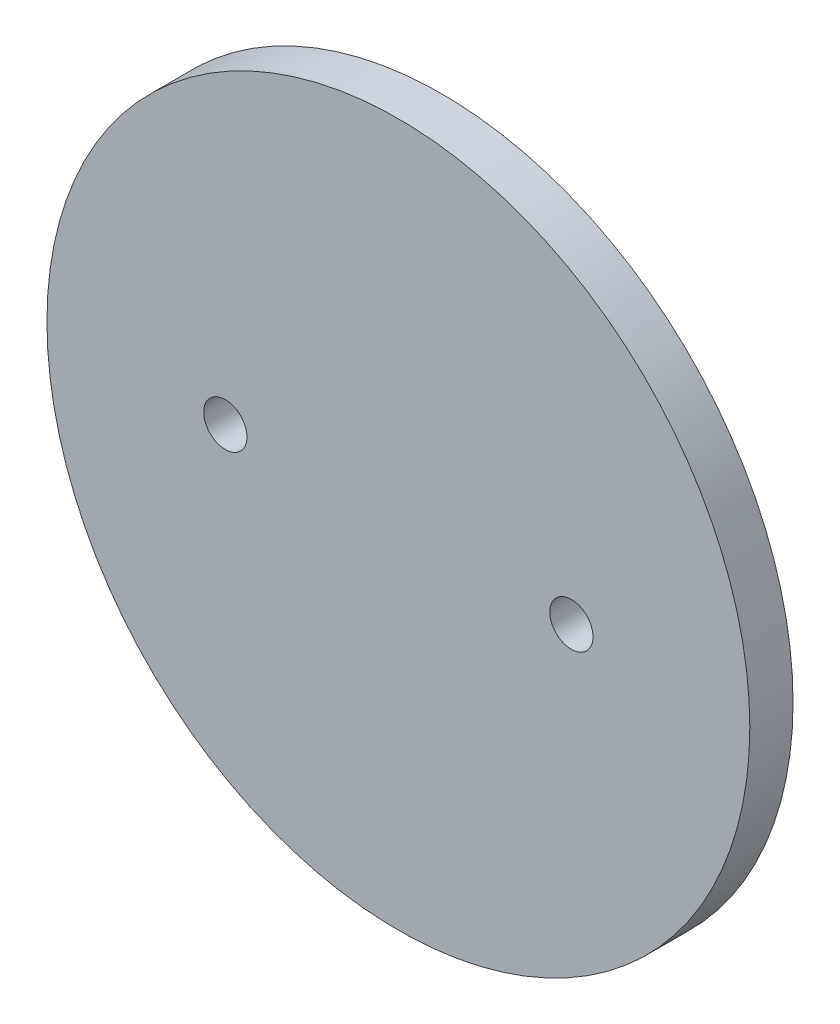
ISO-10303-21;
HEADER;
FILE_DESCRIPTION(('STEP AP214'),'2;1');
FILE_NAME('part.step','',(''),(''),'','','');
FILE_SCHEMA(('AUTOMOTIVE_DESIGN { 1 0 10303 214 1 1 1 1 }'));
ENDSEC;
DATA;
#1=APPLICATION_CONTEXT('core data for automotive mechanical design processes');
#2=APPLICATION_PROTOCOL_DEFINITION('international standard','automotive_design',2000,#1);
#3=PRODUCT_CONTEXT('',#1,'mechanical');
#4=PRODUCT('Part','Part','',(#3));
#5=PRODUCT_RELATED_PRODUCT_CATEGORY('part','',(#4));
#6=PRODUCT_DEFINITION_FORMATION('','',#4);
#7=PRODUCT_DEFINITION_CONTEXT('part definition',#1,'design');
#8=PRODUCT_DEFINITION('design','',#6,#7);
#9=PRODUCT_DEFINITION_SHAPE('','',#8);
#10=(LENGTH_UNIT() NAMED_UNIT(*) SI_UNIT(.MILLI.,.METRE.));
#11=(NAMED_UNIT(*) PLANE_ANGLE_UNIT() SI_UNIT($,.RADIAN.));
#12=(NAMED_UNIT(*) SI_UNIT($,.STERADIAN.) SOLID_ANGLE_UNIT());
#13=UNCERTAINTY_MEASURE_WITH_UNIT(LENGTH_MEASURE(1.E-05),#10,'distance_accuracy_value','');
#14=(GEOMETRIC_REPRESENTATION_CONTEXT(3) GLOBAL_UNCERTAINTY_ASSIGNED_CONTEXT((#13)) GLOBAL_UNIT_ASSIGNED_CONTEXT((#10,
#11,#12)) REPRESENTATION_CONTEXT('',''));
#15=CARTESIAN_POINT('',(0.,0.,0.));
#16=DIRECTION('',(0.,0.,1.));
#17=DIRECTION('',(1.,0.,0.));
#18=AXIS2_PLACEMENT_3D('',#15,#16,#17);
#19=CARTESIAN_POINT('',(0.,0.,2.54));
#20=DIRECTION('',(0.,0.,-1.));
#21=DIRECTION('',(-1.,0.,0.));
#22=AXIS2_PLACEMENT_3D('',#19,#20,#21);
#23=CYLINDRICAL_SURFACE('',#22,20.6375);
#24=CARTESIAN_POINT('',(0.,0.,2.54));
#25=DIRECTION('',(0.,0.,1.));
#26=DIRECTION('',(1.,0.,0.));
#27=AXIS2_PLACEMENT_3D('',#24,#25,#26);
#28=CIRCLE('',#27,20.6375);
#29=CARTESIAN_POINT('',(20.6375,0.,2.54));
#30=VERTEX_POINT('',#29);
#31=EDGE_CURVE('E10',#30,#30,#28,.T.);
#32=ORIENTED_EDGE('',*,*,#31,.F.);
#33=EDGE_LOOP('',(#32));
#34=FACE_BOUND('',#33,.T.);
#35=CARTESIAN_POINT('',(0.,0.,0.));
#36=DIRECTION('',(0.,0.,1.));
#37=DIRECTION('',(1.,0.,0.));
#38=AXIS2_PLACEMENT_3D('',#35,#36,#37);
#39=CIRCLE('',#38,20.6375);
#40=CARTESIAN_POINT('',(20.6375,0.,0.));
#41=VERTEX_POINT('',#40);
#42=EDGE_CURVE('E35',#41,#41,#39,.T.);
#43=ORIENTED_EDGE('',*,*,#42,.T.);
#44=EDGE_LOOP('',(#43));
#45=FACE_BOUND('',#44,.T.);
#46=ADVANCED_FACE('F32',(#34,#45),#23,.T.);
#47=CARTESIAN_POINT('',(0.,0.,2.54));
#48=DIRECTION('',(0.,0.,1.));
#49=DIRECTION('',(1.,0.,0.));
#50=AXIS2_PLACEMENT_3D('',#47,#48,#49);
#51=PLANE('',#50);
#52=CARTESIAN_POINT('',(-10.16,0.,2.54));
#53=DIRECTION('',(0.,0.,1.));
#54=DIRECTION('',(1.,0.,0.));
#55=AXIS2_PLACEMENT_3D('',#52,#53,#54);
#56=CIRCLE('',#55,1.27);
#57=CARTESIAN_POINT('',(-8.89,0.,2.54));
#58=VERTEX_POINT('',#57);
#59=EDGE_CURVE('E50',#58,#58,#56,.T.);
#60=ORIENTED_EDGE('',*,*,#59,.F.);
#61=EDGE_LOOP('',(#60));
#62=FACE_BOUND('',#61,.T.);
#63=CARTESIAN_POINT('',(10.16,0.,2.54));
#64=DIRECTION('',(0.,0.,1.));
#65=DIRECTION('',(1.,0.,0.));
#66=AXIS2_PLACEMENT_3D('',#63,#64,#65);
#67=CIRCLE('',#66,1.27);
#68=CARTESIAN_POINT('',(11.43,0.,2.54));
#69=VERTEX_POINT('',#68);
#70=EDGE_CURVE('E44',#69,#69,#67,.T.);
#71=ORIENTED_EDGE('',*,*,#70,.F.);
#72=EDGE_LOOP('',(#71));
#73=FACE_BOUND('',#72,.T.);
#74=ORIENTED_EDGE('',*,*,#31,.T.);
#75=EDGE_LOOP('',(#74));
#76=FACE_BOUND('',#75,.T.);
#77=ADVANCED_FACE('F66',(#62,#73,#76),#51,.T.);
#78=CARTESIAN_POINT('',(0.,0.,0.));
#79=DIRECTION('',(0.,0.,1.));
#80=DIRECTION('',(1.,0.,0.));
#81=AXIS2_PLACEMENT_3D('',#78,#79,#80);
#82=PLANE('',#81);
#83=CARTESIAN_POINT('',(-10.16,0.,0.));
#84=DIRECTION('',(0.,0.,1.));
#85=DIRECTION('',(1.,0.,0.));
#86=AXIS2_PLACEMENT_3D('',#83,#84,#85);
#87=CIRCLE('',#86,1.27);
#88=CARTESIAN_POINT('',(-8.89,0.,0.));
#89=VERTEX_POINT('',#88);
#90=EDGE_CURVE('E42',#89,#89,#87,.T.);
#91=ORIENTED_EDGE('',*,*,#90,.T.);
#92=EDGE_LOOP('',(#91));
#93=FACE_BOUND('',#92,.T.);
#94=CARTESIAN_POINT('',(10.16,0.,0.));
#95=DIRECTION('',(0.,0.,1.));
#96=DIRECTION('',(1.,0.,0.));
#97=AXIS2_PLACEMENT_3D('',#94,#95,#96);
#98=CIRCLE('',#97,1.27);
#99=CARTESIAN_POINT('',(11.43,0.,0.));
#100=VERTEX_POINT('',#99);
#101=EDGE_CURVE('E47',#100,#100,#98,.T.);
#102=ORIENTED_EDGE('',*,*,#101,.T.);
#103=EDGE_LOOP('',(#102));
#104=FACE_BOUND('',#103,.T.);
#105=ORIENTED_EDGE('',*,*,#42,.F.);
#106=EDGE_LOOP('',(#105));
#107=FACE_BOUND('',#106,.T.);
#108=ADVANCED_FACE('F56',(#93,#104,#107),#82,.F.);
#109=CARTESIAN_POINT('',(10.16,0.,0.));
#110=DIRECTION('',(0.,0.,1.));
#111=DIRECTION('',(1.,0.,0.));
#112=AXIS2_PLACEMENT_3D('',#109,#110,#111);
#113=CYLINDRICAL_SURFACE('',#112,1.27);
#114=ORIENTED_EDGE('',*,*,#101,.F.);
#115=EDGE_LOOP('',(#114));
#116=FACE_BOUND('',#115,.T.);
#117=ORIENTED_EDGE('',*,*,#70,.T.);
#118=EDGE_LOOP('',(#117));
#119=FACE_BOUND('',#118,.T.);
#120=ADVANCED_FACE('F62',(#116,#119),#113,.F.);
#121=CARTESIAN_POINT('',(-10.16,0.,0.));
#122=DIRECTION('',(0.,0.,1.));
#123=DIRECTION('',(1.,0.,0.));
#124=AXIS2_PLACEMENT_3D('',#121,#122,#123);
#125=CYLINDRICAL_SURFACE('',#124,1.27);
#126=ORIENTED_EDGE('',*,*,#90,.F.);
#127=EDGE_LOOP('',(#126));
#128=FACE_BOUND('',#127,.T.);
#129=ORIENTED_EDGE('',*,*,#59,.T.);
#130=EDGE_LOOP('',(#129));
#131=FACE_BOUND('',#130,.T.);
#132=ADVANCED_FACE('F59',(#128,#131),#125,.F.);
#133=CLOSED_SHELL('',(#46,#77,#108,#120,#132));
#134=MANIFOLD_SOLID_BREP('B2',#133);
#135=ADVANCED_BREP_SHAPE_REPRESENTATION('',(#18,#134),#14);
#136=SHAPE_DEFINITION_REPRESENTATION(#9,#135);
ENDSEC;
END-ISO-10303-21;
